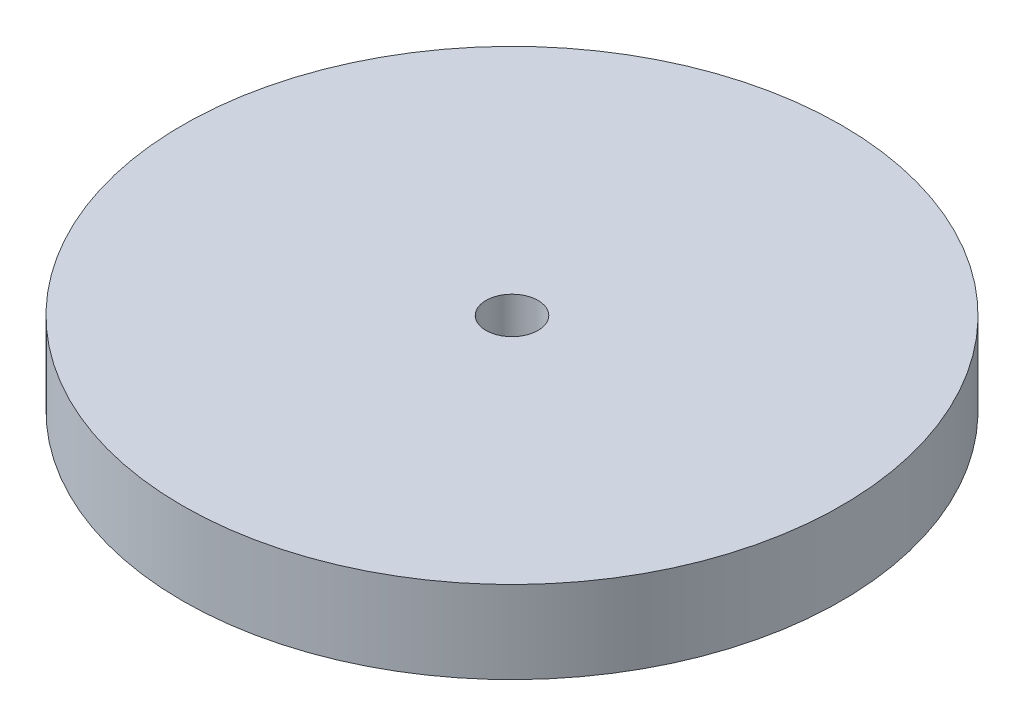
ISO-10303-21;
HEADER;
FILE_DESCRIPTION(('STEP AP214'),'2;1');
FILE_NAME('part.step','',(''),(''),'','','');
FILE_SCHEMA(('AUTOMOTIVE_DESIGN { 1 0 10303 214 1 1 1 1 }'));
ENDSEC;
DATA;
#1=APPLICATION_CONTEXT('core data for automotive mechanical design processes');
#2=APPLICATION_PROTOCOL_DEFINITION('international standard','automotive_design',2000,#1);
#3=PRODUCT_CONTEXT('',#1,'mechanical');
#4=PRODUCT('Part','Part','',(#3));
#5=PRODUCT_RELATED_PRODUCT_CATEGORY('part','',(#4));
#6=PRODUCT_DEFINITION_FORMATION('','',#4);
#7=PRODUCT_DEFINITION_CONTEXT('part definition',#1,'design');
#8=PRODUCT_DEFINITION('design','',#6,#7);
#9=PRODUCT_DEFINITION_SHAPE('','',#8);
#10=(LENGTH_UNIT() NAMED_UNIT(*) SI_UNIT(.MILLI.,.METRE.));
#11=(NAMED_UNIT(*) PLANE_ANGLE_UNIT() SI_UNIT($,.RADIAN.));
#12=(NAMED_UNIT(*) SI_UNIT($,.STERADIAN.) SOLID_ANGLE_UNIT());
#13=UNCERTAINTY_MEASURE_WITH_UNIT(LENGTH_MEASURE(1.E-05),#10,'distance_accuracy_value','');
#14=(GEOMETRIC_REPRESENTATION_CONTEXT(3) GLOBAL_UNCERTAINTY_ASSIGNED_CONTEXT((#13)) GLOBAL_UNIT_ASSIGNED_CONTEXT((#10,
#11,#12)) REPRESENTATION_CONTEXT('',''));
#15=CARTESIAN_POINT('',(0.,0.,0.));
#16=DIRECTION('',(0.,0.,1.));
#17=DIRECTION('',(1.,0.,0.));
#18=AXIS2_PLACEMENT_3D('',#15,#16,#17);
#19=CARTESIAN_POINT('',(0.,6.35,0.));
#20=DIRECTION('',(0.,1.,0.));
#21=DIRECTION('',(0.,0.,1.));
#22=AXIS2_PLACEMENT_3D('',#19,#20,#21);
#23=PLANE('',#22);
#24=CARTESIAN_POINT('',(0.,6.35,0.));
#25=DIRECTION('',(0.,1.,0.));
#26=DIRECTION('',(0.,0.,1.));
#27=AXIS2_PLACEMENT_3D('',#24,#25,#26);
#28=CIRCLE('',#27,25.4);
#29=CARTESIAN_POINT('',(0.,6.35,25.4));
#30=VERTEX_POINT('',#29);
#31=EDGE_CURVE('E10',#30,#30,#28,.T.);
#32=ORIENTED_EDGE('',*,*,#31,.T.);
#33=EDGE_LOOP('',(#32));
#34=FACE_BOUND('',#33,.T.);
#35=CARTESIAN_POINT('',(0.,6.35,0.));
#36=DIRECTION('',(0.,1.,0.));
#37=DIRECTION('',(0.,0.,1.));
#38=AXIS2_PLACEMENT_3D('',#35,#36,#37);
#39=CIRCLE('',#38,2.0066);
#40=CARTESIAN_POINT('',(0.,6.35,2.0066));
#41=VERTEX_POINT('',#40);
#42=EDGE_CURVE('E42',#41,#41,#39,.T.);
#43=ORIENTED_EDGE('',*,*,#42,.F.);
#44=EDGE_LOOP('',(#43));
#45=FACE_BOUND('',#44,.T.);
#46=ADVANCED_FACE('F31',(#34,#45),#23,.T.);
#47=CARTESIAN_POINT('',(0.,0.,0.));
#48=DIRECTION('',(0.,1.,0.));
#49=DIRECTION('',(0.,0.,1.));
#50=AXIS2_PLACEMENT_3D('',#47,#48,#49);
#51=PLANE('',#50);
#52=CARTESIAN_POINT('',(0.,0.,0.));
#53=DIRECTION('',(0.,1.,0.));
#54=DIRECTION('',(0.,0.,1.));
#55=AXIS2_PLACEMENT_3D('',#52,#53,#54);
#56=CIRCLE('',#55,25.4);
#57=CARTESIAN_POINT('',(0.,0.,25.4));
#58=VERTEX_POINT('',#57);
#59=EDGE_CURVE('E35',#58,#58,#56,.T.);
#60=ORIENTED_EDGE('',*,*,#59,.F.);
#61=EDGE_LOOP('',(#60));
#62=FACE_BOUND('',#61,.T.);
#63=CARTESIAN_POINT('',(0.,0.,0.));
#64=DIRECTION('',(0.,1.,0.));
#65=DIRECTION('',(0.,0.,1.));
#66=AXIS2_PLACEMENT_3D('',#63,#64,#65);
#67=CIRCLE('',#66,2.0066);
#68=CARTESIAN_POINT('',(0.,0.,2.0066));
#69=VERTEX_POINT('',#68);
#70=EDGE_CURVE('E44',#69,#69,#67,.T.);
#71=ORIENTED_EDGE('',*,*,#70,.T.);
#72=EDGE_LOOP('',(#71));
#73=FACE_BOUND('',#72,.T.);
#74=ADVANCED_FACE('F54',(#62,#73),#51,.F.);
#75=CARTESIAN_POINT('',(0.,6.35,0.));
#76=DIRECTION('',(0.,-1.,0.));
#77=DIRECTION('',(0.,0.,-1.));
#78=AXIS2_PLACEMENT_3D('',#75,#76,#77);
#79=CYLINDRICAL_SURFACE('',#78,25.4);
#80=ORIENTED_EDGE('',*,*,#31,.F.);
#81=EDGE_LOOP('',(#80));
#82=FACE_BOUND('',#81,.T.);
#83=ORIENTED_EDGE('',*,*,#59,.T.);
#84=EDGE_LOOP('',(#83));
#85=FACE_BOUND('',#84,.T.);
#86=ADVANCED_FACE('F33',(#82,#85),#79,.T.);
#87=CARTESIAN_POINT('',(0.,6.35,0.));
#88=DIRECTION('',(0.,-1.,0.));
#89=DIRECTION('',(0.,0.,-1.));
#90=AXIS2_PLACEMENT_3D('',#87,#88,#89);
#91=CYLINDRICAL_SURFACE('',#90,2.0066);
#92=ORIENTED_EDGE('',*,*,#42,.T.);
#93=EDGE_LOOP('',(#92));
#94=FACE_BOUND('',#93,.T.);
#95=ORIENTED_EDGE('',*,*,#70,.F.);
#96=EDGE_LOOP('',(#95));
#97=FACE_BOUND('',#96,.T.);
#98=ADVANCED_FACE('F50',(#94,#97),#91,.F.);
#99=CLOSED_SHELL('',(#46,#74,#86,#98));
#100=MANIFOLD_SOLID_BREP('B2',#99);
#101=ADVANCED_BREP_SHAPE_REPRESENTATION('',(#18,#100),#14);
#102=SHAPE_DEFINITION_REPRESENTATION(#9,#101);
ENDSEC;
END-ISO-10303-21;
